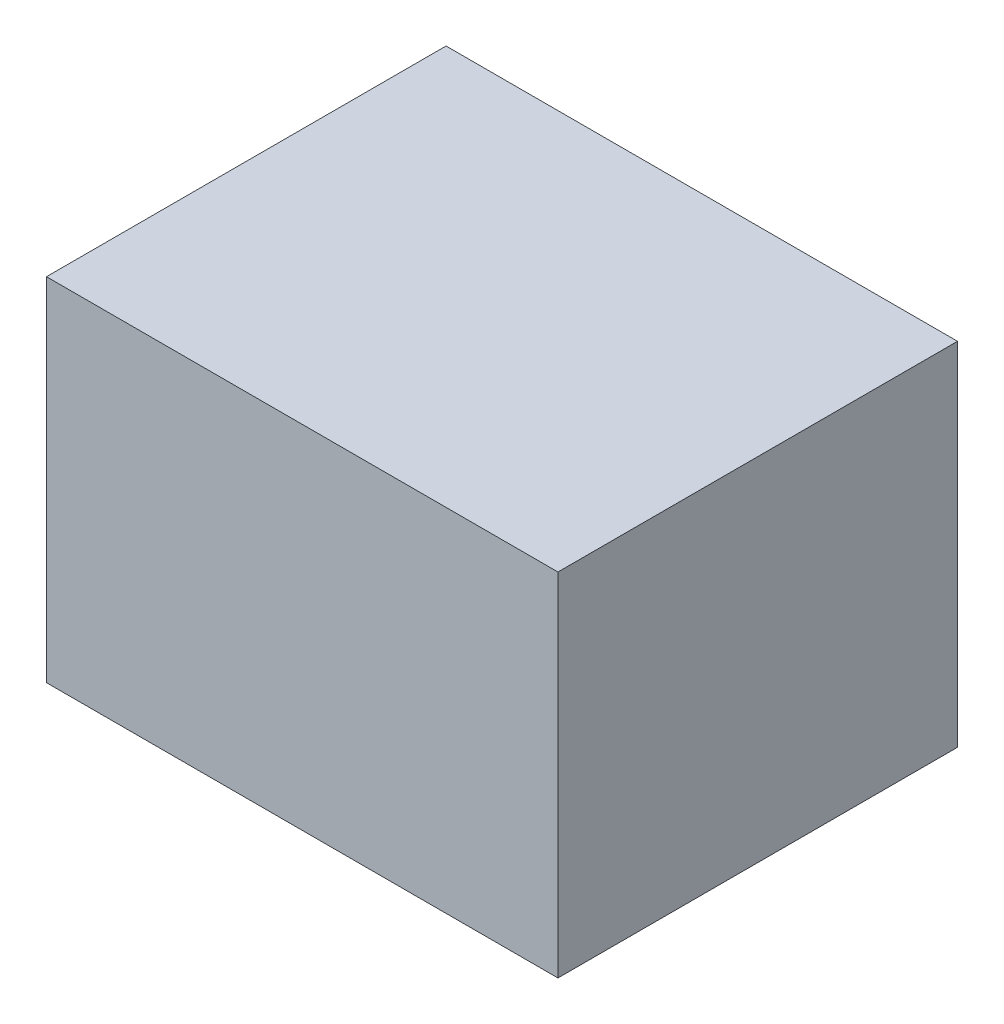
ISO-10303-21;
HEADER;
FILE_DESCRIPTION(('STEP AP214'),'2;1');
FILE_NAME('part.step','',(''),(''),'','','');
FILE_SCHEMA(('AUTOMOTIVE_DESIGN { 1 0 10303 214 1 1 1 1 }'));
ENDSEC;
DATA;
#1=APPLICATION_CONTEXT('core data for automotive mechanical design processes');
#2=APPLICATION_PROTOCOL_DEFINITION('international standard','automotive_design',2000,#1);
#3=PRODUCT_CONTEXT('',#1,'mechanical');
#4=PRODUCT('Part','Part','',(#3));
#5=PRODUCT_RELATED_PRODUCT_CATEGORY('part','',(#4));
#6=PRODUCT_DEFINITION_FORMATION('','',#4);
#7=PRODUCT_DEFINITION_CONTEXT('part definition',#1,'design');
#8=PRODUCT_DEFINITION('design','',#6,#7);
#9=PRODUCT_DEFINITION_SHAPE('','',#8);
#10=(LENGTH_UNIT() NAMED_UNIT(*) SI_UNIT(.MILLI.,.METRE.));
#11=(NAMED_UNIT(*) PLANE_ANGLE_UNIT() SI_UNIT($,.RADIAN.));
#12=(NAMED_UNIT(*) SI_UNIT($,.STERADIAN.) SOLID_ANGLE_UNIT());
#13=UNCERTAINTY_MEASURE_WITH_UNIT(LENGTH_MEASURE(1.E-05),#10,'distance_accuracy_value','');
#14=(GEOMETRIC_REPRESENTATION_CONTEXT(3) GLOBAL_UNCERTAINTY_ASSIGNED_CONTEXT((#13)) GLOBAL_UNIT_ASSIGNED_CONTEXT((#10,
#11,#12)) REPRESENTATION_CONTEXT('',''));
#15=CARTESIAN_POINT('',(0.,0.,0.));
#16=DIRECTION('',(0.,0.,1.));
#17=DIRECTION('',(1.,0.,0.));
#18=AXIS2_PLACEMENT_3D('',#15,#16,#17);
#19=CARTESIAN_POINT('',(-203.2,279.4,158.75));
#20=DIRECTION('',(1.,0.,0.));
#21=DIRECTION('',(0.,0.,-1.));
#22=AXIS2_PLACEMENT_3D('',#19,#20,#21);
#23=PLANE('',#22);
#24=DIRECTION('',(0.,0.,1.));
#25=VECTOR('',#24,1.);
#26=CARTESIAN_POINT('',(-203.2,0.,158.75));
#27=LINE('',#26,#25);
#28=CARTESIAN_POINT('',(-203.2,0.,-158.75));
#29=VERTEX_POINT('',#28);
#30=CARTESIAN_POINT('',(-203.2,0.,158.75));
#31=VERTEX_POINT('',#30);
#32=EDGE_CURVE('E107',#29,#31,#27,.T.);
#33=ORIENTED_EDGE('',*,*,#32,.T.);
#34=DIRECTION('',(0.,-1.,0.));
#35=VECTOR('',#34,1.);
#36=CARTESIAN_POINT('',(-203.2,279.4,158.75));
#37=LINE('',#36,#35);
#38=CARTESIAN_POINT('',(-203.2,279.4,158.75));
#39=VERTEX_POINT('',#38);
#40=EDGE_CURVE('E11',#39,#31,#37,.T.);
#41=ORIENTED_EDGE('',*,*,#40,.F.);
#42=DIRECTION('',(0.,0.,1.));
#43=VECTOR('',#42,1.);
#44=CARTESIAN_POINT('',(-203.2,279.4,158.75));
#45=LINE('',#44,#43);
#46=CARTESIAN_POINT('',(-203.2,279.4,-158.75));
#47=VERTEX_POINT('',#46);
#48=EDGE_CURVE('E91',#47,#39,#45,.T.);
#49=ORIENTED_EDGE('',*,*,#48,.F.);
#50=DIRECTION('',(0.,-1.,0.));
#51=VECTOR('',#50,1.);
#52=CARTESIAN_POINT('',(-203.2,279.4,-158.75));
#53=LINE('',#52,#51);
#54=EDGE_CURVE('E103',#47,#29,#53,.T.);
#55=ORIENTED_EDGE('',*,*,#54,.T.);
#56=EDGE_LOOP('',(#33,#41,#49,#55));
#57=FACE_BOUND('',#56,.T.);
#58=ADVANCED_FACE('F39',(#57),#23,.F.);
#59=CARTESIAN_POINT('',(-203.2,279.4,158.75));
#60=DIRECTION('',(0.,0.,-1.));
#61=DIRECTION('',(-1.,0.,0.));
#62=AXIS2_PLACEMENT_3D('',#59,#60,#61);
#63=PLANE('',#62);
#64=DIRECTION('',(1.,0.,0.));
#65=VECTOR('',#64,1.);
#66=CARTESIAN_POINT('',(-203.2,0.,158.75));
#67=LINE('',#66,#65);
#68=CARTESIAN_POINT('',(203.2,0.,158.75));
#69=VERTEX_POINT('',#68);
#70=EDGE_CURVE('E96',#31,#69,#67,.T.);
#71=ORIENTED_EDGE('',*,*,#70,.T.);
#72=DIRECTION('',(0.,-1.,0.));
#73=VECTOR('',#72,1.);
#74=CARTESIAN_POINT('',(203.2,279.4,158.75));
#75=LINE('',#74,#73);
#76=CARTESIAN_POINT('',(203.2,279.4,158.75));
#77=VERTEX_POINT('',#76);
#78=EDGE_CURVE('E48',#77,#69,#75,.T.);
#79=ORIENTED_EDGE('',*,*,#78,.F.);
#80=DIRECTION('',(1.,0.,0.));
#81=VECTOR('',#80,1.);
#82=CARTESIAN_POINT('',(-203.2,279.4,158.75));
#83=LINE('',#82,#81);
#84=EDGE_CURVE('E86',#39,#77,#83,.T.);
#85=ORIENTED_EDGE('',*,*,#84,.F.);
#86=ORIENTED_EDGE('',*,*,#40,.T.);
#87=EDGE_LOOP('',(#71,#79,#85,#86));
#88=FACE_BOUND('',#87,.T.);
#89=ADVANCED_FACE('F95',(#88),#63,.F.);
#90=CARTESIAN_POINT('',(203.2,279.4,158.75));
#91=DIRECTION('',(-1.,0.,0.));
#92=DIRECTION('',(0.,0.,1.));
#93=AXIS2_PLACEMENT_3D('',#90,#91,#92);
#94=PLANE('',#93);
#95=DIRECTION('',(0.,0.,-1.));
#96=VECTOR('',#95,1.);
#97=CARTESIAN_POINT('',(203.2,0.,158.75));
#98=LINE('',#97,#96);
#99=CARTESIAN_POINT('',(203.2,0.,-158.75));
#100=VERTEX_POINT('',#99);
#101=EDGE_CURVE('E73',#69,#100,#98,.T.);
#102=ORIENTED_EDGE('',*,*,#101,.T.);
#103=DIRECTION('',(0.,-1.,0.));
#104=VECTOR('',#103,1.);
#105=CARTESIAN_POINT('',(203.2,279.4,-158.75));
#106=LINE('',#105,#104);
#107=CARTESIAN_POINT('',(203.2,279.4,-158.75));
#108=VERTEX_POINT('',#107);
#109=EDGE_CURVE('E98',#108,#100,#106,.T.);
#110=ORIENTED_EDGE('',*,*,#109,.F.);
#111=DIRECTION('',(0.,0.,-1.));
#112=VECTOR('',#111,1.);
#113=CARTESIAN_POINT('',(203.2,279.4,158.75));
#114=LINE('',#113,#112);
#115=EDGE_CURVE('E89',#77,#108,#114,.T.);
#116=ORIENTED_EDGE('',*,*,#115,.F.);
#117=ORIENTED_EDGE('',*,*,#78,.T.);
#118=EDGE_LOOP('',(#102,#110,#116,#117));
#119=FACE_BOUND('',#118,.T.);
#120=ADVANCED_FACE('F99',(#119),#94,.F.);
#121=CARTESIAN_POINT('',(-203.2,279.4,-158.75));
#122=DIRECTION('',(0.,0.,1.));
#123=DIRECTION('',(1.,0.,0.));
#124=AXIS2_PLACEMENT_3D('',#121,#122,#123);
#125=PLANE('',#124);
#126=DIRECTION('',(-1.,0.,0.));
#127=VECTOR('',#126,1.);
#128=CARTESIAN_POINT('',(-203.2,0.,-158.75));
#129=LINE('',#128,#127);
#130=EDGE_CURVE('E79',#100,#29,#129,.T.);
#131=ORIENTED_EDGE('',*,*,#130,.T.);
#132=ORIENTED_EDGE('',*,*,#54,.F.);
#133=DIRECTION('',(-1.,0.,0.));
#134=VECTOR('',#133,1.);
#135=CARTESIAN_POINT('',(-203.2,279.4,-158.75));
#136=LINE('',#135,#134);
#137=EDGE_CURVE('E56',#108,#47,#136,.T.);
#138=ORIENTED_EDGE('',*,*,#137,.F.);
#139=ORIENTED_EDGE('',*,*,#109,.T.);
#140=EDGE_LOOP('',(#131,#132,#138,#139));
#141=FACE_BOUND('',#140,.T.);
#142=ADVANCED_FACE('F120',(#141),#125,.F.);
#143=CARTESIAN_POINT('',(0.,279.4,0.));
#144=DIRECTION('',(0.,-1.,0.));
#145=DIRECTION('',(0.,0.,-1.));
#146=AXIS2_PLACEMENT_3D('',#143,#144,#145);
#147=PLANE('',#146);
#148=ORIENTED_EDGE('',*,*,#48,.T.);
#149=ORIENTED_EDGE('',*,*,#84,.T.);
#150=ORIENTED_EDGE('',*,*,#115,.T.);
#151=ORIENTED_EDGE('',*,*,#137,.T.);
#152=EDGE_LOOP('',(#148,#149,#150,#151));
#153=FACE_BOUND('',#152,.T.);
#154=ADVANCED_FACE('F87',(#153),#147,.F.);
#155=CARTESIAN_POINT('',(0.,0.,0.));
#156=DIRECTION('',(0.,-1.,0.));
#157=DIRECTION('',(0.,0.,-1.));
#158=AXIS2_PLACEMENT_3D('',#155,#156,#157);
#159=PLANE('',#158);
#160=ORIENTED_EDGE('',*,*,#32,.F.);
#161=ORIENTED_EDGE('',*,*,#130,.F.);
#162=ORIENTED_EDGE('',*,*,#101,.F.);
#163=ORIENTED_EDGE('',*,*,#70,.F.);
#164=EDGE_LOOP('',(#160,#161,#162,#163));
#165=FACE_BOUND('',#164,.T.);
#166=ADVANCED_FACE('F123',(#165),#159,.T.);
#167=CLOSED_SHELL('',(#58,#89,#120,#142,#154,#166));
#168=MANIFOLD_SOLID_BREP('B2',#167);
#169=ADVANCED_BREP_SHAPE_REPRESENTATION('',(#18,#168),#14);
#170=SHAPE_DEFINITION_REPRESENTATION(#9,#169);
ENDSEC;
END-ISO-10303-21;
